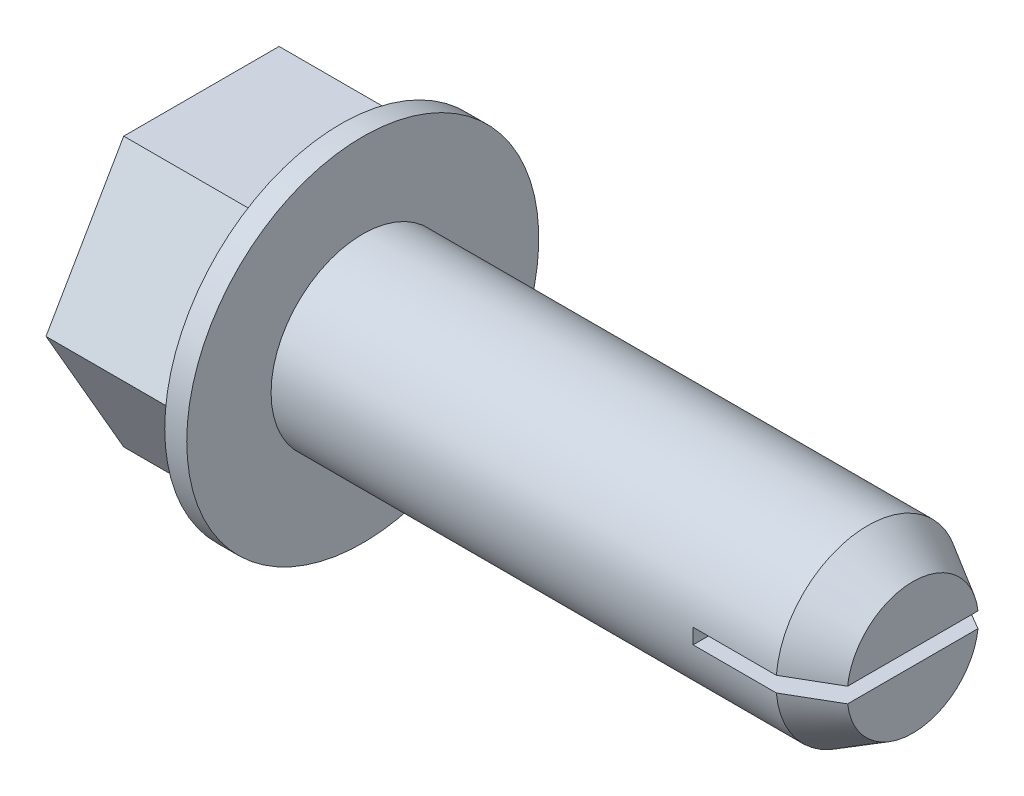
ISO-10303-21;
HEADER;
FILE_DESCRIPTION(('STEP AP214'),'2;1');
FILE_NAME('part.step','',(''),(''),'','','');
FILE_SCHEMA(('AUTOMOTIVE_DESIGN { 1 0 10303 214 1 1 1 1 }'));
ENDSEC;
DATA;
#1=APPLICATION_CONTEXT('core data for automotive mechanical design processes');
#2=APPLICATION_PROTOCOL_DEFINITION('international standard','automotive_design',2000,#1);
#3=PRODUCT_CONTEXT('',#1,'mechanical');
#4=PRODUCT('Part','Part','',(#3));
#5=PRODUCT_RELATED_PRODUCT_CATEGORY('part','',(#4));
#6=PRODUCT_DEFINITION_FORMATION('','',#4);
#7=PRODUCT_DEFINITION_CONTEXT('part definition',#1,'design');
#8=PRODUCT_DEFINITION('design','',#6,#7);
#9=PRODUCT_DEFINITION_SHAPE('','',#8);
#10=(LENGTH_UNIT() NAMED_UNIT(*) SI_UNIT(.MILLI.,.METRE.));
#11=(NAMED_UNIT(*) PLANE_ANGLE_UNIT() SI_UNIT($,.RADIAN.));
#12=(NAMED_UNIT(*) SI_UNIT($,.STERADIAN.) SOLID_ANGLE_UNIT());
#13=UNCERTAINTY_MEASURE_WITH_UNIT(LENGTH_MEASURE(1.E-05),#10,'distance_accuracy_value','');
#14=(GEOMETRIC_REPRESENTATION_CONTEXT(3) GLOBAL_UNCERTAINTY_ASSIGNED_CONTEXT((#13)) GLOBAL_UNIT_ASSIGNED_CONTEXT((#10,
#11,#12)) REPRESENTATION_CONTEXT('',''));
#15=CARTESIAN_POINT('',(0.,0.,0.));
#16=DIRECTION('',(0.,0.,1.));
#17=DIRECTION('',(1.,0.,0.));
#18=AXIS2_PLACEMENT_3D('',#15,#16,#17);
#19=CARTESIAN_POINT('',(-4.6228,3.72872,0.));
#20=DIRECTION('',(1.,0.,0.));
#21=DIRECTION('',(0.,0.,-1.));
#22=AXIS2_PLACEMENT_3D('',#19,#20,#21);
#23=PLANE('',#22);
#24=CARTESIAN_POINT('',(-4.6228,0.,0.));
#25=DIRECTION('',(-1.,0.,0.));
#26=DIRECTION('',(0.,0.,1.));
#27=AXIS2_PLACEMENT_3D('',#24,#25,#26);
#28=CIRCLE('',#27,3.72872);
#29=CARTESIAN_POINT('',(-4.6228,0.,3.72872));
#30=VERTEX_POINT('',#29);
#31=EDGE_CURVE('E17',#30,#30,#28,.T.);
#32=ORIENTED_EDGE('',*,*,#31,.T.);
#33=EDGE_LOOP('',(#32));
#34=FACE_BOUND('',#33,.T.);
#35=ADVANCED_FACE('F14',(#34),#23,.F.);
#36=CARTESIAN_POINT('',(0.,0.,0.));
#37=DIRECTION('',(-1.,0.,0.));
#38=DIRECTION('',(0.,0.,1.));
#39=AXIS2_PLACEMENT_3D('',#36,#37,#38);
#40=CYLINDRICAL_SURFACE('',#39,3.72872);
#41=ORIENTED_EDGE('',*,*,#31,.F.);
#42=EDGE_LOOP('',(#41));
#43=FACE_BOUND('',#42,.T.);
#44=CARTESIAN_POINT('',(-5.588,0.,0.));
#45=DIRECTION('',(-1.,0.,0.));
#46=DIRECTION('',(0.,0.,1.));
#47=AXIS2_PLACEMENT_3D('',#44,#45,#46);
#48=CIRCLE('',#47,3.72872);
#49=CARTESIAN_POINT('',(-5.588,0.,3.72872));
#50=VERTEX_POINT('',#49);
#51=EDGE_CURVE('E122',#50,#50,#48,.T.);
#52=ORIENTED_EDGE('',*,*,#51,.T.);
#53=EDGE_LOOP('',(#52));
#54=FACE_BOUND('',#53,.T.);
#55=ADVANCED_FACE('F209',(#43,#54),#40,.F.);
#56=CARTESIAN_POINT('',(-5.588,4.6609,0.));
#57=DIRECTION('',(1.,0.,0.));
#58=DIRECTION('',(0.,0.,-1.));
#59=AXIS2_PLACEMENT_3D('',#56,#57,#58);
#60=PLANE('',#59);
#61=DIRECTION('',(0.,0.,-1.));
#62=VECTOR('',#61,1.);
#63=CARTESIAN_POINT('',(-5.58799999998882,-4.6609,0.));
#64=LINE('',#63,#62);
#65=CARTESIAN_POINT('',(-5.58800000007968,-4.6609,2.69097186966593));
#66=VERTEX_POINT('',#65);
#67=CARTESIAN_POINT('',(-5.58799999999441,-4.6609,-2.69097186966593));
#68=VERTEX_POINT('',#67);
#69=EDGE_CURVE('E119',#66,#68,#64,.T.);
#70=ORIENTED_EDGE('',*,*,#69,.F.);
#71=DIRECTION('',(0.,-0.866025403784439,-0.5));
#72=VECTOR('',#71,1.);
#73=CARTESIAN_POINT('',(-5.5880000002162,-10.7431892055105,-0.820639440424718));
#74=LINE('',#73,#72);
#75=CARTESIAN_POINT('',(-5.58800000007968,0.,5.38194373933185));
#76=VERTEX_POINT('',#75);
#77=EDGE_CURVE('E114',#76,#66,#74,.T.);
#78=ORIENTED_EDGE('',*,*,#77,.F.);
#79=DIRECTION('',(0.,-0.866025403784439,0.5));
#80=VECTOR('',#79,1.);
#81=CARTESIAN_POINT('',(-5.58799999998882,-6.08228920551051,8.8935550494225));
#82=LINE('',#81,#80);
#83=CARTESIAN_POINT('',(-5.58799999999441,4.6609,2.69097186966593));
#84=VERTEX_POINT('',#83);
#85=EDGE_CURVE('E111',#84,#76,#82,.T.);
#86=ORIENTED_EDGE('',*,*,#85,.F.);
#87=DIRECTION('',(0.,0.,1.));
#88=VECTOR('',#87,1.);
#89=CARTESIAN_POINT('',(-5.58799999998882,4.6609,0.));
#90=LINE('',#89,#88);
#91=CARTESIAN_POINT('',(-5.58800000007968,4.6609,-2.69097186966593));
#92=VERTEX_POINT('',#91);
#93=EDGE_CURVE('E131',#92,#84,#90,.T.);
#94=ORIENTED_EDGE('',*,*,#93,.F.);
#95=DIRECTION('',(0.,0.866025403784439,0.5));
#96=VECTOR('',#95,1.);
#97=CARTESIAN_POINT('',(-5.5880000002162,-6.08228920551051,-8.8935550494225));
#98=LINE('',#97,#96);
#99=CARTESIAN_POINT('',(-5.58800000016215,0.,-5.38194373933185));
#100=VERTEX_POINT('',#99);
#101=EDGE_CURVE('E278',#100,#92,#98,.T.);
#102=ORIENTED_EDGE('',*,*,#101,.F.);
#103=DIRECTION('',(0.,0.866025403784439,-0.5));
#104=VECTOR('',#103,1.);
#105=CARTESIAN_POINT('',(-5.58799999998882,-10.7431892055105,0.82063944042472));
#106=LINE('',#105,#104);
#107=EDGE_CURVE('E270',#68,#100,#106,.T.);
#108=ORIENTED_EDGE('',*,*,#107,.F.);
#109=EDGE_LOOP('',(#70,#78,#86,#94,#102,#108));
#110=FACE_BOUND('',#109,.T.);
#111=ORIENTED_EDGE('',*,*,#51,.F.);
#112=EDGE_LOOP('',(#111));
#113=FACE_BOUND('',#112,.T.);
#114=ADVANCED_FACE('F116',(#110,#113),#60,.F.);
#115=CARTESIAN_POINT('',(500000.,-10.7431892055105,-0.820639440424718));
#116=DIRECTION('',(0.,-0.5,0.866025403784439));
#117=DIRECTION('',(0.,-0.866025403784439,-0.5));
#118=AXIS2_PLACEMENT_3D('',#115,#116,#117);
#119=PLANE('',#118);
#120=DIRECTION('',(0.,0.866025403784439,0.5));
#121=VECTOR('',#120,1.);
#122=CARTESIAN_POINT('',(-0.762,-4.6609,2.69097186966593));
#123=LINE('',#122,#121);
#124=CARTESIAN_POINT('',(-0.762000000091873,-4.6609,2.69097186966593));
#125=VERTEX_POINT('',#124);
#126=CARTESIAN_POINT('',(-0.762000000177139,0.,5.38194373933185));
#127=VERTEX_POINT('',#126);
#128=EDGE_CURVE('E128',#125,#127,#123,.T.);
#129=ORIENTED_EDGE('',*,*,#128,.T.);
#130=DIRECTION('',(1.,0.,0.));
#131=VECTOR('',#130,1.);
#132=CARTESIAN_POINT('',(500000.,0.,5.38194373933185));
#133=LINE('',#132,#131);
#134=EDGE_CURVE('E125',#76,#127,#133,.T.);
#135=ORIENTED_EDGE('',*,*,#134,.F.);
#136=ORIENTED_EDGE('',*,*,#77,.T.);
#137=DIRECTION('',(1.,0.,0.));
#138=VECTOR('',#137,1.);
#139=CARTESIAN_POINT('',(500000.,-4.6609,2.69097186966593));
#140=LINE('',#139,#138);
#141=EDGE_CURVE('E265',#125,#66,#140,.F.);
#142=ORIENTED_EDGE('',*,*,#141,.F.);
#143=EDGE_LOOP('',(#129,#135,#136,#142));
#144=FACE_BOUND('',#143,.T.);
#145=ADVANCED_FACE('F126',(#144),#119,.T.);
#146=CARTESIAN_POINT('',(500000.,-6.08228920551051,8.8935550494225));
#147=DIRECTION('',(0.,0.5,0.866025403784439));
#148=DIRECTION('',(0.,-0.866025403784439,0.5));
#149=AXIS2_PLACEMENT_3D('',#146,#147,#148);
#150=PLANE('',#149);
#151=DIRECTION('',(0.,0.866025403784439,-0.5));
#152=VECTOR('',#151,1.);
#153=CARTESIAN_POINT('',(-0.762,0.,5.38194373933185));
#154=LINE('',#153,#152);
#155=CARTESIAN_POINT('',(-0.762000000006608,4.6609,2.69097186966593));
#156=VERTEX_POINT('',#155);
#157=EDGE_CURVE('E262',#127,#156,#154,.T.);
#158=ORIENTED_EDGE('',*,*,#157,.T.);
#159=DIRECTION('',(1.,0.,0.));
#160=VECTOR('',#159,1.);
#161=CARTESIAN_POINT('',(500000.,4.6609,2.69097186966592));
#162=LINE('',#161,#160);
#163=EDGE_CURVE('E135',#84,#156,#162,.T.);
#164=ORIENTED_EDGE('',*,*,#163,.F.);
#165=ORIENTED_EDGE('',*,*,#85,.T.);
#166=ORIENTED_EDGE('',*,*,#134,.T.);
#167=EDGE_LOOP('',(#158,#164,#165,#166));
#168=FACE_BOUND('',#167,.T.);
#169=ADVANCED_FACE('F133',(#168),#150,.T.);
#170=CARTESIAN_POINT('',(500000.,4.6609,0.));
#171=DIRECTION('',(0.,1.,0.));
#172=DIRECTION('',(0.,0.,1.));
#173=AXIS2_PLACEMENT_3D('',#170,#171,#172);
#174=PLANE('',#173);
#175=DIRECTION('',(0.,0.,-1.));
#176=VECTOR('',#175,1.);
#177=CARTESIAN_POINT('',(-0.762,4.6609,0.));
#178=LINE('',#177,#176);
#179=CARTESIAN_POINT('',(-0.762000000049241,4.6609,-2.69097186966592));
#180=VERTEX_POINT('',#179);
#181=EDGE_CURVE('E260',#156,#180,#178,.T.);
#182=ORIENTED_EDGE('',*,*,#181,.T.);
#183=DIRECTION('',(1.,0.,0.));
#184=VECTOR('',#183,1.);
#185=CARTESIAN_POINT('',(500000.,4.6609,-2.69097186966592));
#186=LINE('',#185,#184);
#187=EDGE_CURVE('E275',#92,#180,#186,.T.);
#188=ORIENTED_EDGE('',*,*,#187,.F.);
#189=ORIENTED_EDGE('',*,*,#93,.T.);
#190=ORIENTED_EDGE('',*,*,#163,.T.);
#191=EDGE_LOOP('',(#182,#188,#189,#190));
#192=FACE_BOUND('',#191,.T.);
#193=ADVANCED_FACE('F283',(#192),#174,.T.);
#194=CARTESIAN_POINT('',(500000.,-6.08228920551051,-8.8935550494225));
#195=DIRECTION('',(0.,0.5,-0.866025403784439));
#196=DIRECTION('',(0.,0.866025403784439,0.5));
#197=AXIS2_PLACEMENT_3D('',#194,#195,#196);
#198=PLANE('',#197);
#199=DIRECTION('',(0.,-0.866025403784439,-0.5));
#200=VECTOR('',#199,1.);
#201=CARTESIAN_POINT('',(-0.762,4.6609,-2.69097186966593));
#202=LINE('',#201,#200);
#203=CARTESIAN_POINT('',(-0.762000000148717,0.,-5.38194373933185));
#204=VERTEX_POINT('',#203);
#205=EDGE_CURVE('E258',#180,#204,#202,.T.);
#206=ORIENTED_EDGE('',*,*,#205,.T.);
#207=DIRECTION('',(1.,0.,0.));
#208=VECTOR('',#207,1.);
#209=CARTESIAN_POINT('',(500000.,0.,-5.38194373933185));
#210=LINE('',#209,#208);
#211=EDGE_CURVE('E273',#100,#204,#210,.T.);
#212=ORIENTED_EDGE('',*,*,#211,.F.);
#213=ORIENTED_EDGE('',*,*,#101,.T.);
#214=ORIENTED_EDGE('',*,*,#187,.T.);
#215=EDGE_LOOP('',(#206,#212,#213,#214));
#216=FACE_BOUND('',#215,.T.);
#217=ADVANCED_FACE('F287',(#216),#198,.T.);
#218=CARTESIAN_POINT('',(500000.,-10.7431892055105,0.82063944042472));
#219=DIRECTION('',(0.,-0.5,-0.866025403784439));
#220=DIRECTION('',(0.,0.866025403784439,-0.5));
#221=AXIS2_PLACEMENT_3D('',#218,#219,#220);
#222=PLANE('',#221);
#223=DIRECTION('',(1.,0.,0.));
#224=VECTOR('',#223,1.);
#225=CARTESIAN_POINT('',(500000.,-4.6609,-2.69097186966593));
#226=LINE('',#225,#224);
#227=CARTESIAN_POINT('',(-0.761999999949765,-4.6609,-2.69097186966593));
#228=VERTEX_POINT('',#227);
#229=EDGE_CURVE('E267',#68,#228,#226,.T.);
#230=ORIENTED_EDGE('',*,*,#229,.F.);
#231=ORIENTED_EDGE('',*,*,#107,.T.);
#232=ORIENTED_EDGE('',*,*,#211,.T.);
#233=DIRECTION('',(0.,-0.866025403784439,0.499999999999999));
#234=VECTOR('',#233,1.);
#235=CARTESIAN_POINT('',(-0.762,0.,-5.38194373933185));
#236=LINE('',#235,#234);
#237=EDGE_CURVE('E78',#204,#228,#236,.T.);
#238=ORIENTED_EDGE('',*,*,#237,.T.);
#239=EDGE_LOOP('',(#230,#231,#232,#238));
#240=FACE_BOUND('',#239,.T.);
#241=ADVANCED_FACE('F289',(#240),#222,.T.);
#242=CARTESIAN_POINT('',(500000.,-4.6609,0.));
#243=DIRECTION('',(0.,-1.,0.));
#244=DIRECTION('',(0.,0.,-1.));
#245=AXIS2_PLACEMENT_3D('',#242,#243,#244);
#246=PLANE('',#245);
#247=DIRECTION('',(0.,0.,-1.));
#248=VECTOR('',#247,1.);
#249=CARTESIAN_POINT('',(-0.762,-4.6609,0.));
#250=LINE('',#249,#248);
#251=EDGE_CURVE('E201',#228,#125,#250,.F.);
#252=ORIENTED_EDGE('',*,*,#251,.T.);
#253=ORIENTED_EDGE('',*,*,#141,.T.);
#254=ORIENTED_EDGE('',*,*,#69,.T.);
#255=ORIENTED_EDGE('',*,*,#229,.T.);
#256=EDGE_LOOP('',(#252,#253,#254,#255));
#257=FACE_BOUND('',#256,.T.);
#258=ADVANCED_FACE('F292',(#257),#246,.T.);
#259=CARTESIAN_POINT('',(-0.762,6.096,0.));
#260=DIRECTION('',(1.,0.,0.));
#261=DIRECTION('',(0.,0.,-1.));
#262=AXIS2_PLACEMENT_3D('',#259,#260,#261);
#263=PLANE('',#262);
#264=CARTESIAN_POINT('',(-0.762,0.,0.));
#265=DIRECTION('',(-1.,0.,0.));
#266=DIRECTION('',(0.,0.,1.));
#267=AXIS2_PLACEMENT_3D('',#264,#265,#266);
#268=CIRCLE('',#267,6.096);
#269=CARTESIAN_POINT('',(-0.762,0.,6.096));
#270=VERTEX_POINT('',#269);
#271=EDGE_CURVE('E199',#270,#270,#268,.F.);
#272=ORIENTED_EDGE('',*,*,#271,.F.);
#273=EDGE_LOOP('',(#272));
#274=FACE_BOUND('',#273,.T.);
#275=ORIENTED_EDGE('',*,*,#237,.F.);
#276=ORIENTED_EDGE('',*,*,#205,.F.);
#277=ORIENTED_EDGE('',*,*,#181,.F.);
#278=ORIENTED_EDGE('',*,*,#157,.F.);
#279=ORIENTED_EDGE('',*,*,#128,.F.);
#280=ORIENTED_EDGE('',*,*,#251,.F.);
#281=EDGE_LOOP('',(#275,#276,#277,#278,#279,#280));
#282=FACE_BOUND('',#281,.T.);
#283=ADVANCED_FACE('F294',(#274,#282),#263,.F.);
#284=CARTESIAN_POINT('',(19.05,3.175,0.));
#285=DIRECTION('',(-1.,0.,0.));
#286=DIRECTION('',(0.,0.,1.));
#287=AXIS2_PLACEMENT_3D('',#284,#285,#286);
#288=PLANE('',#287);
#289=DIRECTION('',(0.,0.,-1.));
#290=VECTOR('',#289,1.);
#291=CARTESIAN_POINT('',(19.05,-0.264583333333333,-6.096));
#292=LINE('',#291,#290);
#293=CARTESIAN_POINT('',(19.0500000000004,-0.264583333333333,-2.25785042680903));
#294=VERTEX_POINT('',#293);
#295=CARTESIAN_POINT('',(19.0499999999965,-0.264583333333333,2.25785042681133));
#296=VERTEX_POINT('',#295);
#297=EDGE_CURVE('E197',#294,#296,#292,.F.);
#298=ORIENTED_EDGE('',*,*,#297,.T.);
#299=CARTESIAN_POINT('',(19.0499999999929,0.,0.));
#300=DIRECTION('',(-1.,0.,0.));
#301=DIRECTION('',(0.,0.,1.));
#302=AXIS2_PLACEMENT_3D('',#299,#300,#301);
#303=CIRCLE('',#302,2.27330000003061);
#304=EDGE_CURVE('E69',#294,#296,#303,.T.);
#305=ORIENTED_EDGE('',*,*,#304,.F.);
#306=EDGE_LOOP('',(#298,#305));
#307=FACE_BOUND('',#306,.T.);
#308=ADVANCED_FACE('F296',(#307),#288,.F.);
#309=CARTESIAN_POINT('',(0.,0.,0.));
#310=DIRECTION('',(-1.,0.,0.));
#311=DIRECTION('',(0.,0.,1.));
#312=AXIS2_PLACEMENT_3D('',#309,#310,#311);
#313=CYLINDRICAL_SURFACE('',#312,6.096);
#314=ORIENTED_EDGE('',*,*,#271,.T.);
#315=EDGE_LOOP('',(#314));
#316=FACE_BOUND('',#315,.T.);
#317=CARTESIAN_POINT('',(0.,0.,0.));
#318=DIRECTION('',(-1.,0.,0.));
#319=DIRECTION('',(0.,0.,1.));
#320=AXIS2_PLACEMENT_3D('',#317,#318,#319);
#321=CIRCLE('',#320,6.096);
#322=CARTESIAN_POINT('',(0.,0.,6.096));
#323=VERTEX_POINT('',#322);
#324=EDGE_CURVE('E238',#323,#323,#321,.T.);
#325=ORIENTED_EDGE('',*,*,#324,.T.);
#326=EDGE_LOOP('',(#325));
#327=FACE_BOUND('',#326,.T.);
#328=ADVANCED_FACE('F303',(#316,#327),#313,.T.);
#329=CARTESIAN_POINT('',(17.488209787075,0.,0.));
#330=DIRECTION('',(-1.,0.,0.));
#331=DIRECTION('',(0.,0.,1.));
#332=AXIS2_PLACEMENT_3D('',#329,#330,#331);
#333=CONICAL_SURFACE('',#332,3.17499999988513,0.523598775602448);
#334=CARTESIAN_POINT('',(17.4882097868304,-0.264583333333333,-3.16395648830533));
#335=CARTESIAN_POINT('',(17.7485950521458,-0.264583333333333,-3.01308870934584));
#336=CARTESIAN_POINT('',(18.0089562455111,-0.264583333333333,-2.86217927282826));
#337=CARTESIAN_POINT('',(18.3994183217583,-0.264583333333333,-2.63567773139847));
#338=CARTESIAN_POINT('',(18.5295590617472,-0.264583333333333,-2.56015431969282));
#339=CARTESIAN_POINT('',(18.7898067189707,-0.264583333333333,-2.40904920796175));
#340=CARTESIAN_POINT('',(18.9199136362009,-0.264583333333333,-2.333467507929));
#341=CARTESIAN_POINT('',(19.0500000000079,-0.264583333333333,-2.25785042680467));
#342=B_SPLINE_CURVE_WITH_KNOTS('',3,(#334,#335,#336,#337,#338,#339,#340,#341),.UNSPECIFIED.,.F.,
.F.,(4,2,2,4),(0.,0.902803568709945,1.35420535449983,1.80560719706211),.UNSPECIFIED.);
#343=CARTESIAN_POINT('',(17.4882097868228,-0.264583333333333,-3.16395648829212));
#344=VERTEX_POINT('',#343);
#345=EDGE_CURVE('E192',#344,#294,#342,.T.);
#346=ORIENTED_EDGE('',*,*,#345,.T.);
#347=ORIENTED_EDGE('',*,*,#304,.T.);
#348=CARTESIAN_POINT('',(19.0500000000073,-0.264583333333333,2.257850426805));
#349=CARTESIAN_POINT('',(18.9199136362004,-0.264583333333333,2.3334675079293));
#350=CARTESIAN_POINT('',(18.7898067189702,-0.264583333333333,2.40904920796202));
#351=CARTESIAN_POINT('',(18.5295590617469,-0.264583333333333,2.56015431969304));
#352=CARTESIAN_POINT('',(18.3994183217579,-0.264583333333333,2.63567773139866));
#353=CARTESIAN_POINT('',(18.0089562455109,-0.264583333333333,2.86217927282837));
#354=CARTESIAN_POINT('',(17.7485950521457,-0.264583333333333,3.01308870934589));
#355=CARTESIAN_POINT('',(17.4882097868304,-0.264583333333333,3.16395648830533));
#356=B_SPLINE_CURVE_WITH_KNOTS('',3,(#348,#349,#350,#351,#352,#353,#354,#355),.UNSPECIFIED.,.F.,
.F.,(4,2,2,4),(0.,0.451401842562117,0.902803628351839,1.80560719706146),.UNSPECIFIED.);
#357=CARTESIAN_POINT('',(17.4882097868228,-0.264583333333333,3.16395648829212));
#358=VERTEX_POINT('',#357);
#359=EDGE_CURVE('E186',#296,#358,#356,.T.);
#360=ORIENTED_EDGE('',*,*,#359,.T.);
#361=CARTESIAN_POINT('',(17.4882097868151,0.,0.));
#362=DIRECTION('',(-1.,0.,0.));
#363=DIRECTION('',(0.,0.,1.));
#364=AXIS2_PLACEMENT_3D('',#361,#362,#363);
#365=CIRCLE('',#364,3.175);
#366=EDGE_CURVE('E247',#344,#358,#365,.T.);
#367=ORIENTED_EDGE('',*,*,#366,.F.);
#368=EDGE_LOOP('',(#346,#347,#360,#367));
#369=FACE_BOUND('',#368,.T.);
#370=ADVANCED_FACE('F180',(#369),#333,.T.);
#371=CARTESIAN_POINT('',(14.605,-0.264583333333333,-6.096));
#372=DIRECTION('',(0.,-1.,0.));
#373=DIRECTION('',(0.,0.,-1.));
#374=AXIS2_PLACEMENT_3D('',#371,#372,#373);
#375=PLANE('',#374);
#376=ORIENTED_EDGE('',*,*,#297,.F.);
#377=ORIENTED_EDGE('',*,*,#345,.F.);
#378=DIRECTION('',(-1.,0.,0.));
#379=VECTOR('',#378,1.);
#380=CARTESIAN_POINT('',(0.,-0.264583333333333,-3.16395648827891));
#381=LINE('',#380,#379);
#382=CARTESIAN_POINT('',(14.605,-0.264583333333333,-3.16395648827891));
#383=VERTEX_POINT('',#382);
#384=EDGE_CURVE('E250',#383,#344,#381,.F.);
#385=ORIENTED_EDGE('',*,*,#384,.F.);
#386=DIRECTION('',(0.,0.,1.));
#387=VECTOR('',#386,1.);
#388=CARTESIAN_POINT('',(14.605,-0.264583333333333,-6.096));
#389=LINE('',#388,#387);
#390=CARTESIAN_POINT('',(14.605,-0.264583333333333,3.16395648827891));
#391=VERTEX_POINT('',#390);
#392=EDGE_CURVE('E236',#383,#391,#389,.T.);
#393=ORIENTED_EDGE('',*,*,#392,.T.);
#394=DIRECTION('',(-1.,0.,0.));
#395=VECTOR('',#394,1.);
#396=CARTESIAN_POINT('',(0.,-0.264583333333333,3.16395648827891));
#397=LINE('',#396,#395);
#398=EDGE_CURVE('E243',#358,#391,#397,.T.);
#399=ORIENTED_EDGE('',*,*,#398,.F.);
#400=ORIENTED_EDGE('',*,*,#359,.F.);
#401=EDGE_LOOP('',(#376,#377,#385,#393,#399,#400));
#402=FACE_BOUND('',#401,.T.);
#403=ADVANCED_FACE('F175',(#402),#375,.F.);
#404=CARTESIAN_POINT('',(14.605,0.264583333333333,-6.096));
#405=DIRECTION('',(-1.,0.,0.));
#406=DIRECTION('',(0.,0.,1.));
#407=AXIS2_PLACEMENT_3D('',#404,#405,#406);
#408=PLANE('',#407);
#409=DIRECTION('',(0.,0.,1.));
#410=VECTOR('',#409,1.);
#411=CARTESIAN_POINT('',(14.605,0.264583333333333,-6.096));
#412=LINE('',#411,#410);
#413=CARTESIAN_POINT('',(14.605,0.264583333333334,-3.16395648827891));
#414=VERTEX_POINT('',#413);
#415=CARTESIAN_POINT('',(14.605,0.264583333333333,3.16395648827891));
#416=VERTEX_POINT('',#415);
#417=EDGE_CURVE('E239',#414,#416,#412,.T.);
#418=ORIENTED_EDGE('',*,*,#417,.T.);
#419=CARTESIAN_POINT('',(14.605,0.,0.));
#420=DIRECTION('',(-1.,0.,0.));
#421=DIRECTION('',(0.,0.,1.));
#422=AXIS2_PLACEMENT_3D('',#419,#420,#421);
#423=CIRCLE('',#422,3.175);
#424=EDGE_CURVE('E246',#391,#416,#423,.T.);
#425=ORIENTED_EDGE('',*,*,#424,.F.);
#426=ORIENTED_EDGE('',*,*,#392,.F.);
#427=CARTESIAN_POINT('',(14.605,0.,0.));
#428=DIRECTION('',(-1.,0.,0.));
#429=DIRECTION('',(0.,0.,1.));
#430=AXIS2_PLACEMENT_3D('',#427,#428,#429);
#431=CIRCLE('',#430,3.175);
#432=EDGE_CURVE('E253',#414,#383,#431,.T.);
#433=ORIENTED_EDGE('',*,*,#432,.F.);
#434=EDGE_LOOP('',(#418,#425,#426,#433));
#435=FACE_BOUND('',#434,.T.);
#436=ADVANCED_FACE('F171',(#435),#408,.F.);
#437=CARTESIAN_POINT('',(19.05,3.175,0.));
#438=DIRECTION('',(-1.,0.,0.));
#439=DIRECTION('',(0.,0.,1.));
#440=AXIS2_PLACEMENT_3D('',#437,#438,#439);
#441=PLANE('',#440);
#442=DIRECTION('',(0.,0.,1.));
#443=VECTOR('',#442,1.);
#444=CARTESIAN_POINT('',(19.05,0.264583333333333,-6.096));
#445=LINE('',#444,#443);
#446=CARTESIAN_POINT('',(19.0500000000004,0.264583333333333,2.25785042680903));
#447=VERTEX_POINT('',#446);
#448=CARTESIAN_POINT('',(19.0499999999965,0.264583333333333,-2.25785042681133));
#449=VERTEX_POINT('',#448);
#450=EDGE_CURVE('E150',#447,#449,#445,.F.);
#451=ORIENTED_EDGE('',*,*,#450,.T.);
#452=CARTESIAN_POINT('',(19.0499999999929,0.,0.));
#453=DIRECTION('',(-1.,0.,0.));
#454=DIRECTION('',(0.,0.,1.));
#455=AXIS2_PLACEMENT_3D('',#452,#453,#454);
#456=CIRCLE('',#455,2.27330000003061);
#457=EDGE_CURVE('E242',#447,#449,#456,.T.);
#458=ORIENTED_EDGE('',*,*,#457,.F.);
#459=EDGE_LOOP('',(#451,#458));
#460=FACE_BOUND('',#459,.T.);
#461=ADVANCED_FACE('F167',(#460),#441,.F.);
#462=CARTESIAN_POINT('',(0.,3.175,0.));
#463=DIRECTION('',(-1.,0.,0.));
#464=DIRECTION('',(0.,0.,1.));
#465=AXIS2_PLACEMENT_3D('',#462,#463,#464);
#466=PLANE('',#465);
#467=CARTESIAN_POINT('',(0.,0.,0.));
#468=DIRECTION('',(-1.,0.,0.));
#469=DIRECTION('',(0.,0.,1.));
#470=AXIS2_PLACEMENT_3D('',#467,#468,#469);
#471=CIRCLE('',#470,3.175);
#472=CARTESIAN_POINT('',(0.,0.,3.175));
#473=VERTEX_POINT('',#472);
#474=EDGE_CURVE('E140',#473,#473,#471,.F.);
#475=ORIENTED_EDGE('',*,*,#474,.F.);
#476=EDGE_LOOP('',(#475));
#477=FACE_BOUND('',#476,.T.);
#478=ORIENTED_EDGE('',*,*,#324,.F.);
#479=EDGE_LOOP('',(#478));
#480=FACE_BOUND('',#479,.T.);
#481=ADVANCED_FACE('F163',(#477,#480),#466,.F.);
#482=CARTESIAN_POINT('',(17.488209787075,0.,0.));
#483=DIRECTION('',(-1.,0.,0.));
#484=DIRECTION('',(0.,0.,1.));
#485=AXIS2_PLACEMENT_3D('',#482,#483,#484);
#486=CONICAL_SURFACE('',#485,3.17499999988513,0.523598775602448);
#487=CARTESIAN_POINT('',(17.4882097868351,0.264583333333333,3.16395648830265));
#488=CARTESIAN_POINT('',(17.7485950521496,0.264583333333333,3.0130887093436));
#489=CARTESIAN_POINT('',(18.0089562455142,0.264583333333333,2.86217927282647));
#490=CARTESIAN_POINT('',(18.3994183217602,0.264583333333333,2.63567773139735));
#491=CARTESIAN_POINT('',(18.5295590617488,0.264583333333333,2.56015431969193));
#492=CARTESIAN_POINT('',(18.7898067189715,0.264583333333333,2.40904920796131));
#493=CARTESIAN_POINT('',(18.9199136362013,0.264583333333333,2.33346750792877));
#494=CARTESIAN_POINT('',(19.0500000000079,0.264583333333333,2.25785042680467));
#495=B_SPLINE_CURVE_WITH_KNOTS('',3,(#487,#488,#489,#490,#491,#492,#493,#494),.UNSPECIFIED.,.F.,
.F.,(4,2,2,4),(0.,0.902803568707271,1.35420535449581,1.80560719705676),.UNSPECIFIED.);
#496=CARTESIAN_POINT('',(17.4882097868251,0.264583333333333,3.16395648829078));
#497=VERTEX_POINT('',#496);
#498=EDGE_CURVE('E151',#497,#447,#495,.T.);
#499=ORIENTED_EDGE('',*,*,#498,.T.);
#500=ORIENTED_EDGE('',*,*,#457,.T.);
#501=CARTESIAN_POINT('',(19.0500000000051,0.264583333333333,-2.25785042680627));
#502=CARTESIAN_POINT('',(18.9199136361991,0.264583333333333,-2.33346750793001));
#503=CARTESIAN_POINT('',(18.7898067189699,0.264583333333333,-2.40904920796219));
#504=CARTESIAN_POINT('',(18.5295590617485,0.264583333333333,-2.5601543196921));
#505=CARTESIAN_POINT('',(18.3994183217605,0.264583333333333,-2.63567773139716));
#506=CARTESIAN_POINT('',(18.0089562455164,0.264583333333333,-2.86217927282522));
#507=CARTESIAN_POINT('',(17.748595052153,0.264583333333333,-3.01308870934164));
#508=CARTESIAN_POINT('',(17.4882097868397,0.264583333333333,-3.16395648829997));
#509=B_SPLINE_CURVE_WITH_KNOTS('',3,(#501,#502,#503,#504,#505,#506,#507,#508),.UNSPECIFIED.,.F.,
.F.,(4,2,2,4),(0.,0.451401842558815,0.902803628345232,1.80560719704824),.UNSPECIFIED.);
#510=CARTESIAN_POINT('',(17.4882097868274,0.264583333333334,-3.16395648828944));
#511=VERTEX_POINT('',#510);
#512=EDGE_CURVE('E32',#449,#511,#509,.T.);
#513=ORIENTED_EDGE('',*,*,#512,.T.);
#514=CARTESIAN_POINT('',(17.4882097868151,0.,0.));
#515=DIRECTION('',(-1.,0.,0.));
#516=DIRECTION('',(0.,0.,1.));
#517=AXIS2_PLACEMENT_3D('',#514,#515,#516);
#518=CIRCLE('',#517,3.175);
#519=EDGE_CURVE('E23',#497,#511,#518,.T.);
#520=ORIENTED_EDGE('',*,*,#519,.F.);
#521=EDGE_LOOP('',(#499,#500,#513,#520));
#522=FACE_BOUND('',#521,.T.);
#523=ADVANCED_FACE('F159',(#522),#486,.T.);
#524=CARTESIAN_POINT('',(14.605,0.264583333333333,-6.096));
#525=DIRECTION('',(0.,1.,0.));
#526=DIRECTION('',(0.,0.,1.));
#527=AXIS2_PLACEMENT_3D('',#524,#525,#526);
#528=PLANE('',#527);
#529=ORIENTED_EDGE('',*,*,#450,.F.);
#530=ORIENTED_EDGE('',*,*,#498,.F.);
#531=DIRECTION('',(-1.,0.,0.));
#532=VECTOR('',#531,1.);
#533=CARTESIAN_POINT('',(0.,0.264583333333334,3.16395648827891));
#534=LINE('',#533,#532);
#535=EDGE_CURVE('E143',#416,#497,#534,.F.);
#536=ORIENTED_EDGE('',*,*,#535,.F.);
#537=ORIENTED_EDGE('',*,*,#417,.F.);
#538=DIRECTION('',(-1.,0.,0.));
#539=VECTOR('',#538,1.);
#540=CARTESIAN_POINT('',(0.,0.264583333333334,-3.16395648827891));
#541=LINE('',#540,#539);
#542=EDGE_CURVE('E9',#511,#414,#541,.T.);
#543=ORIENTED_EDGE('',*,*,#542,.F.);
#544=ORIENTED_EDGE('',*,*,#512,.F.);
#545=EDGE_LOOP('',(#529,#530,#536,#537,#543,#544));
#546=FACE_BOUND('',#545,.T.);
#547=ADVANCED_FACE('F156',(#546),#528,.F.);
#548=CARTESIAN_POINT('',(0.,0.,0.));
#549=DIRECTION('',(-1.,0.,0.));
#550=DIRECTION('',(0.,0.,1.));
#551=AXIS2_PLACEMENT_3D('',#548,#549,#550);
#552=CYLINDRICAL_SURFACE('',#551,3.175);
#553=ORIENTED_EDGE('',*,*,#474,.T.);
#554=EDGE_LOOP('',(#553));
#555=FACE_BOUND('',#554,.T.);
#556=ORIENTED_EDGE('',*,*,#519,.T.);
#557=ORIENTED_EDGE('',*,*,#542,.T.);
#558=ORIENTED_EDGE('',*,*,#432,.T.);
#559=ORIENTED_EDGE('',*,*,#384,.T.);
#560=ORIENTED_EDGE('',*,*,#366,.T.);
#561=ORIENTED_EDGE('',*,*,#398,.T.);
#562=ORIENTED_EDGE('',*,*,#424,.T.);
#563=ORIENTED_EDGE('',*,*,#535,.T.);
#564=EDGE_LOOP('',(#556,#557,#558,#559,#560,#561,#562,#563));
#565=FACE_BOUND('',#564,.T.);
#566=ADVANCED_FACE('F218',(#555,#565),#552,.T.);
#567=CLOSED_SHELL('',(#35,#55,#114,#145,#169,#193,#217,#241,#258,#283,#308,#328,#370,#403,#436,
#461,#481,#523,#547,#566));
#568=MANIFOLD_SOLID_BREP('B1',#567);
#569=ADVANCED_BREP_SHAPE_REPRESENTATION('',(#18,#568),#14);
#570=SHAPE_DEFINITION_REPRESENTATION(#9,#569);
ENDSEC;
END-ISO-10303-21;
